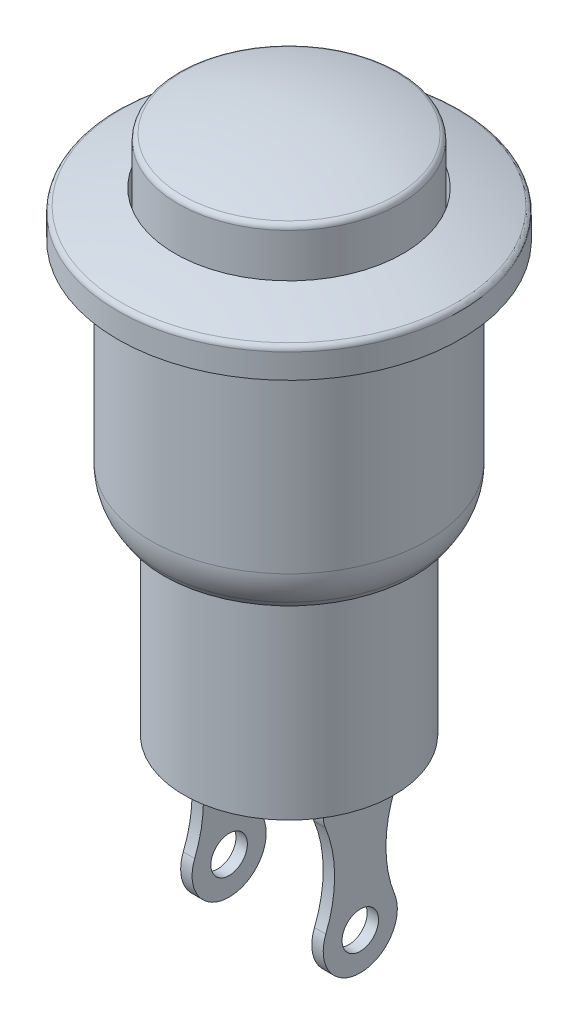
ISO-10303-21;
HEADER;
FILE_DESCRIPTION(('STEP AP214'),'2;1');
FILE_NAME('part.step','',(''),(''),'','','');
FILE_SCHEMA(('AUTOMOTIVE_DESIGN { 1 0 10303 214 1 1 1 1 }'));
ENDSEC;
DATA;
#1=APPLICATION_CONTEXT('core data for automotive mechanical design processes');
#2=APPLICATION_PROTOCOL_DEFINITION('international standard','automotive_design',2000,#1);
#3=PRODUCT_CONTEXT('',#1,'mechanical');
#4=PRODUCT('Part','Part','',(#3));
#5=PRODUCT_RELATED_PRODUCT_CATEGORY('part','',(#4));
#6=PRODUCT_DEFINITION_FORMATION('','',#4);
#7=PRODUCT_DEFINITION_CONTEXT('part definition',#1,'design');
#8=PRODUCT_DEFINITION('design','',#6,#7);
#9=PRODUCT_DEFINITION_SHAPE('','',#8);
#10=(LENGTH_UNIT() NAMED_UNIT(*) SI_UNIT(.MILLI.,.METRE.));
#11=(NAMED_UNIT(*) PLANE_ANGLE_UNIT() SI_UNIT($,.RADIAN.));
#12=(NAMED_UNIT(*) SI_UNIT($,.STERADIAN.) SOLID_ANGLE_UNIT());
#13=UNCERTAINTY_MEASURE_WITH_UNIT(LENGTH_MEASURE(1.E-05),#10,'distance_accuracy_value','');
#14=(GEOMETRIC_REPRESENTATION_CONTEXT(3) GLOBAL_UNCERTAINTY_ASSIGNED_CONTEXT((#13)) GLOBAL_UNIT_ASSIGNED_CONTEXT((#10,
#11,#12)) REPRESENTATION_CONTEXT('',''));
#15=CARTESIAN_POINT('',(0.,0.,0.));
#16=DIRECTION('',(0.,0.,1.));
#17=DIRECTION('',(1.,0.,0.));
#18=AXIS2_PLACEMENT_3D('',#15,#16,#17);
#19=CARTESIAN_POINT('',(-4.53278424106254,-11.3275862665259,23.5));
#20=DIRECTION('',(0.,0.,1.));
#21=DIRECTION('',(1.,0.,0.));
#22=AXIS2_PLACEMENT_3D('',#19,#20,#21);
#23=PLANE('',#22);
#24=DIRECTION('',(0.,1.,0.));
#25=VECTOR('',#24,1.);
#26=CARTESIAN_POINT('',(-4.13278424106254,-11.3275862665259,23.5));
#27=LINE('',#26,#25);
#28=CARTESIAN_POINT('',(-4.13278424106254,-5.91933866888955,23.5));
#29=VERTEX_POINT('',#28);
#30=CARTESIAN_POINT('',(-4.13278424106254,-5.32758626652589,23.5));
#31=VERTEX_POINT('',#30);
#32=EDGE_CURVE('E219',#29,#31,#27,.T.);
#33=ORIENTED_EDGE('',*,*,#32,.F.);
#34=DIRECTION('',(-1.,0.,0.));
#35=VECTOR('',#34,1.);
#36=CARTESIAN_POINT('',(-4.53278424106254,-5.91933866888955,23.5));
#37=LINE('',#36,#35);
#38=CARTESIAN_POINT('',(-4.53278424106254,-5.91933866888955,23.5));
#39=VERTEX_POINT('',#38);
#40=EDGE_CURVE('E24',#29,#39,#37,.T.);
#41=ORIENTED_EDGE('',*,*,#40,.T.);
#42=DIRECTION('',(0.,1.,0.));
#43=VECTOR('',#42,1.);
#44=CARTESIAN_POINT('',(-4.53278424106254,-11.3275862665259,23.5));
#45=LINE('',#44,#43);
#46=CARTESIAN_POINT('',(-4.53278424106254,-5.32758626652589,23.5));
#47=VERTEX_POINT('',#46);
#48=EDGE_CURVE('E221',#39,#47,#45,.T.);
#49=ORIENTED_EDGE('',*,*,#48,.T.);
#50=DIRECTION('',(1.,0.,0.));
#51=VECTOR('',#50,1.);
#52=CARTESIAN_POINT('',(-4.53278424106254,-5.32758626652589,23.5));
#53=LINE('',#52,#51);
#54=EDGE_CURVE('E206',#47,#31,#53,.T.);
#55=ORIENTED_EDGE('',*,*,#54,.T.);
#56=EDGE_LOOP('',(#33,#41,#49,#55));
#57=FACE_BOUND('',#56,.T.);
#58=ADVANCED_FACE('F16',(#57),#23,.F.);
#59=CARTESIAN_POINT('',(0.467215758937459,-11.3275862665259,23.5));
#60=DIRECTION('',(0.,0.,1.));
#61=DIRECTION('',(1.,0.,0.));
#62=AXIS2_PLACEMENT_3D('',#59,#60,#61);
#63=PLANE('',#62);
#64=DIRECTION('',(0.,1.,0.));
#65=VECTOR('',#64,1.);
#66=CARTESIAN_POINT('',(0.467215758937459,-11.3275862665259,23.5));
#67=LINE('',#66,#65);
#68=CARTESIAN_POINT('',(0.467215758937459,-5.91933866888955,23.5));
#69=VERTEX_POINT('',#68);
#70=CARTESIAN_POINT('',(0.467215758937459,-5.32758626652589,23.5));
#71=VERTEX_POINT('',#70);
#72=EDGE_CURVE('E197',#69,#71,#67,.T.);
#73=ORIENTED_EDGE('',*,*,#72,.F.);
#74=DIRECTION('',(-1.,0.,0.));
#75=VECTOR('',#74,1.);
#76=CARTESIAN_POINT('',(0.467215758937459,-5.91933866888955,23.5));
#77=LINE('',#76,#75);
#78=CARTESIAN_POINT('',(0.0672157589374587,-5.91933866888955,23.5));
#79=VERTEX_POINT('',#78);
#80=EDGE_CURVE('E295',#69,#79,#77,.T.);
#81=ORIENTED_EDGE('',*,*,#80,.T.);
#82=DIRECTION('',(0.,1.,0.));
#83=VECTOR('',#82,1.);
#84=CARTESIAN_POINT('',(0.0672157589374587,-11.3275862665259,23.5));
#85=LINE('',#84,#83);
#86=CARTESIAN_POINT('',(0.0672157589374587,-5.32758626652589,23.5));
#87=VERTEX_POINT('',#86);
#88=EDGE_CURVE('E199',#79,#87,#85,.T.);
#89=ORIENTED_EDGE('',*,*,#88,.T.);
#90=DIRECTION('',(1.,0.,0.));
#91=VECTOR('',#90,1.);
#92=CARTESIAN_POINT('',(0.467215758937459,-5.32758626652589,23.5));
#93=LINE('',#92,#91);
#94=EDGE_CURVE('E189',#87,#71,#93,.T.);
#95=ORIENTED_EDGE('',*,*,#94,.T.);
#96=EDGE_LOOP('',(#73,#81,#89,#95));
#97=FACE_BOUND('',#96,.T.);
#98=ADVANCED_FACE('F334',(#97),#63,.F.);
#99=CARTESIAN_POINT('',(-2.03278424106254,-5.32758626652589,24.8));
#100=DIRECTION('',(0.,-1.,0.));
#101=DIRECTION('',(0.,0.,-1.));
#102=AXIS2_PLACEMENT_3D('',#99,#100,#101);
#103=PLANE('',#102);
#104=ORIENTED_EDGE('',*,*,#54,.F.);
#105=DIRECTION('',(0.,0.,-1.));
#106=VECTOR('',#105,1.);
#107=CARTESIAN_POINT('',(-4.53278424106254,-5.32758626652589,26.1));
#108=LINE('',#107,#106);
#109=CARTESIAN_POINT('',(-4.53278424106254,-5.32758626652589,26.1));
#110=VERTEX_POINT('',#109);
#111=EDGE_CURVE('E203',#110,#47,#108,.T.);
#112=ORIENTED_EDGE('',*,*,#111,.F.);
#113=DIRECTION('',(-1.,0.,0.));
#114=VECTOR('',#113,1.);
#115=CARTESIAN_POINT('',(-4.53278424106254,-5.32758626652589,26.1));
#116=LINE('',#115,#114);
#117=CARTESIAN_POINT('',(-4.13278424106254,-5.32758626652589,26.1));
#118=VERTEX_POINT('',#117);
#119=EDGE_CURVE('E212',#118,#110,#116,.T.);
#120=ORIENTED_EDGE('',*,*,#119,.F.);
#121=DIRECTION('',(0.,0.,1.));
#122=VECTOR('',#121,1.);
#123=CARTESIAN_POINT('',(-4.13278424106254,-5.32758626652589,26.1));
#124=LINE('',#123,#122);
#125=EDGE_CURVE('E209',#31,#118,#124,.T.);
#126=ORIENTED_EDGE('',*,*,#125,.F.);
#127=EDGE_LOOP('',(#104,#112,#120,#126));
#128=FACE_BOUND('',#127,.T.);
#129=CARTESIAN_POINT('',(-2.03278424106254,-5.32758626652589,24.8));
#130=DIRECTION('',(0.,-1.,0.));
#131=DIRECTION('',(0.,0.,-1.));
#132=AXIS2_PLACEMENT_3D('',#129,#130,#131);
#133=CIRCLE('',#132,3.69);
#134=CARTESIAN_POINT('',(-2.03278424106254,-5.32758626652589,21.11));
#135=VERTEX_POINT('',#134);
#136=EDGE_CURVE('E232',#135,#135,#133,.T.);
#137=ORIENTED_EDGE('',*,*,#136,.T.);
#138=EDGE_LOOP('',(#137));
#139=FACE_BOUND('',#138,.T.);
#140=DIRECTION('',(0.,0.,-1.));
#141=VECTOR('',#140,1.);
#142=CARTESIAN_POINT('',(0.0672157589374591,-5.32758626652589,26.1));
#143=LINE('',#142,#141);
#144=CARTESIAN_POINT('',(0.0672157589374591,-5.32758626652589,26.1));
#145=VERTEX_POINT('',#144);
#146=EDGE_CURVE('E186',#145,#87,#143,.T.);
#147=ORIENTED_EDGE('',*,*,#146,.F.);
#148=DIRECTION('',(-1.,0.,0.));
#149=VECTOR('',#148,1.);
#150=CARTESIAN_POINT('',(0.467215758937459,-5.32758626652589,26.1));
#151=LINE('',#150,#149);
#152=CARTESIAN_POINT('',(0.467215758937459,-5.32758626652589,26.1));
#153=VERTEX_POINT('',#152);
#154=EDGE_CURVE('E183',#153,#145,#151,.T.);
#155=ORIENTED_EDGE('',*,*,#154,.F.);
#156=DIRECTION('',(0.,0.,1.));
#157=VECTOR('',#156,1.);
#158=CARTESIAN_POINT('',(0.467215758937459,-5.32758626652589,26.1));
#159=LINE('',#158,#157);
#160=EDGE_CURVE('E192',#71,#153,#159,.T.);
#161=ORIENTED_EDGE('',*,*,#160,.F.);
#162=ORIENTED_EDGE('',*,*,#94,.F.);
#163=EDGE_LOOP('',(#147,#155,#161,#162));
#164=FACE_BOUND('',#163,.T.);
#165=ADVANCED_FACE('F310',(#128,#139,#164),#103,.T.);
#166=CARTESIAN_POINT('',(-2.03278424106254,-5.32758626652589,24.8));
#167=DIRECTION('',(0.,-1.,0.));
#168=DIRECTION('',(0.,0.,-1.));
#169=AXIS2_PLACEMENT_3D('',#166,#167,#168);
#170=CYLINDRICAL_SURFACE('',#169,6.01);
#171=CARTESIAN_POINT('',(-2.03278424106254,10.5319052782596,24.8));
#172=DIRECTION('',(0.,-1.,0.));
#173=DIRECTION('',(0.,0.,-1.));
#174=AXIS2_PLACEMENT_3D('',#171,#172,#173);
#175=CIRCLE('',#174,6.01);
#176=CARTESIAN_POINT('',(-2.03278424106254,10.5319052782596,18.79));
#177=VERTEX_POINT('',#176);
#178=EDGE_CURVE('E250',#177,#177,#175,.T.);
#179=ORIENTED_EDGE('',*,*,#178,.T.);
#180=EDGE_LOOP('',(#179));
#181=FACE_BOUND('',#180,.T.);
#182=CARTESIAN_POINT('',(-2.03278424106254,9.67241373347411,24.8));
#183=DIRECTION('',(0.,-1.,0.));
#184=DIRECTION('',(0.,0.,-1.));
#185=AXIS2_PLACEMENT_3D('',#182,#183,#184);
#186=CIRCLE('',#185,6.01);
#187=CARTESIAN_POINT('',(-2.03278424106254,9.67241373347411,18.79));
#188=VERTEX_POINT('',#187);
#189=EDGE_CURVE('E223',#188,#188,#186,.T.);
#190=ORIENTED_EDGE('',*,*,#189,.F.);
#191=EDGE_LOOP('',(#190));
#192=FACE_BOUND('',#191,.T.);
#193=ADVANCED_FACE('F366',(#181,#192),#170,.T.);
#194=CARTESIAN_POINT('',(-2.03278424106254,-5.79433626652587,24.8));
#195=DIRECTION('',(0.,-1.,0.));
#196=DIRECTION('',(1.,0.,0.));
#197=AXIS2_PLACEMENT_3D('',#194,#195,#196);
#198=SPHERICAL_SURFACE('',#197,17.5292314595506);
#199=CARTESIAN_POINT('',(-2.03278424106254,10.720329578355,24.8));
#200=DIRECTION('',(0.,-1.,0.));
#201=DIRECTION('',(0.,0.,-1.));
#202=AXIS2_PLACEMENT_3D('',#199,#200,#201);
#203=CIRCLE('',#202,5.87705432971521);
#204=CARTESIAN_POINT('',(-2.03278424106254,10.720329578355,18.9229456702848));
#205=VERTEX_POINT('',#204);
#206=EDGE_CURVE('E253',#205,#205,#203,.F.);
#207=ORIENTED_EDGE('',*,*,#206,.T.);
#208=EDGE_LOOP('',(#207));
#209=FACE_BOUND('',#208,.T.);
#210=CARTESIAN_POINT('',(-2.03278424106254,11.2724137334741,24.8));
#211=DIRECTION('',(0.,-1.,0.));
#212=DIRECTION('',(0.,0.,-1.));
#213=AXIS2_PLACEMENT_3D('',#210,#211,#212);
#214=CIRCLE('',#213,4.);
#215=CARTESIAN_POINT('',(-2.03278424106254,11.2724137334741,20.8));
#216=VERTEX_POINT('',#215);
#217=EDGE_CURVE('E241',#216,#216,#214,.T.);
#218=ORIENTED_EDGE('',*,*,#217,.T.);
#219=EDGE_LOOP('',(#218));
#220=FACE_BOUND('',#219,.T.);
#221=ADVANCED_FACE('F381',(#209,#220),#198,.T.);
#222=CARTESIAN_POINT('',(-2.03278424106254,-5.32758626652589,24.8));
#223=DIRECTION('',(0.,-1.,0.));
#224=DIRECTION('',(0.,0.,-1.));
#225=AXIS2_PLACEMENT_3D('',#222,#223,#224);
#226=CYLINDRICAL_SURFACE('',#225,4.);
#227=CARTESIAN_POINT('',(-2.03278424106254,9.68560437141453,24.8));
#228=DIRECTION('',(0.,-1.,0.));
#229=DIRECTION('',(0.,0.,-1.));
#230=AXIS2_PLACEMENT_3D('',#227,#228,#229);
#231=CIRCLE('',#230,4.);
#232=CARTESIAN_POINT('',(-2.03278424106254,9.68560437141453,20.8));
#233=VERTEX_POINT('',#232);
#234=EDGE_CURVE('E238',#233,#233,#231,.T.);
#235=ORIENTED_EDGE('',*,*,#234,.T.);
#236=EDGE_LOOP('',(#235));
#237=FACE_BOUND('',#236,.T.);
#238=ORIENTED_EDGE('',*,*,#217,.F.);
#239=EDGE_LOOP('',(#238));
#240=FACE_BOUND('',#239,.T.);
#241=ADVANCED_FACE('F377',(#237,#240),#226,.F.);
#242=CARTESIAN_POINT('',(-2.03278424106254,9.68560437141453,24.8));
#243=DIRECTION('',(0.,1.,0.));
#244=DIRECTION('',(0.,0.,1.));
#245=AXIS2_PLACEMENT_3D('',#242,#243,#244);
#246=PLANE('',#245);
#247=CARTESIAN_POINT('',(-2.03278424106254,9.68560437141453,24.8));
#248=DIRECTION('',(0.,-1.,0.));
#249=DIRECTION('',(0.,0.,-1.));
#250=AXIS2_PLACEMENT_3D('',#247,#248,#249);
#251=CIRCLE('',#250,3.89);
#252=CARTESIAN_POINT('',(-2.03278424106254,9.68560437141453,20.91));
#253=VERTEX_POINT('',#252);
#254=EDGE_CURVE('E235',#253,#253,#251,.T.);
#255=ORIENTED_EDGE('',*,*,#254,.T.);
#256=EDGE_LOOP('',(#255));
#257=FACE_BOUND('',#256,.T.);
#258=ORIENTED_EDGE('',*,*,#234,.F.);
#259=EDGE_LOOP('',(#258));
#260=FACE_BOUND('',#259,.T.);
#261=ADVANCED_FACE('F373',(#257,#260),#246,.T.);
#262=CARTESIAN_POINT('',(-2.03278424106254,-5.32758626652589,24.8));
#263=DIRECTION('',(0.,-1.,0.));
#264=DIRECTION('',(0.,0.,-1.));
#265=AXIS2_PLACEMENT_3D('',#262,#263,#264);
#266=CYLINDRICAL_SURFACE('',#265,3.89);
#267=CARTESIAN_POINT('',(-2.03278424106254,12.7249830031003,24.8));
#268=DIRECTION('',(0.,-1.,0.));
#269=DIRECTION('',(0.,0.,-1.));
#270=AXIS2_PLACEMENT_3D('',#267,#268,#269);
#271=CIRCLE('',#270,3.89);
#272=CARTESIAN_POINT('',(-2.03278424106254,12.7249830031003,20.91));
#273=VERTEX_POINT('',#272);
#274=EDGE_CURVE('E244',#273,#273,#271,.T.);
#275=ORIENTED_EDGE('',*,*,#274,.T.);
#276=EDGE_LOOP('',(#275));
#277=FACE_BOUND('',#276,.T.);
#278=ORIENTED_EDGE('',*,*,#254,.F.);
#279=EDGE_LOOP('',(#278));
#280=FACE_BOUND('',#279,.T.);
#281=ADVANCED_FACE('F369',(#277,#280),#266,.T.);
#282=CARTESIAN_POINT('',(-2.03278424106254,0.562330400140781,24.8));
#283=DIRECTION('',(0.,-1.,0.));
#284=DIRECTION('',(1.,0.,0.));
#285=AXIS2_PLACEMENT_3D('',#282,#283,#284);
#286=SPHERICAL_SURFACE('',#285,12.9100833333333);
#287=CARTESIAN_POINT('',(-2.03278424106254,12.9163688860089,24.8));
#288=DIRECTION('',(0.,-1.,0.));
#289=DIRECTION('',(0.,0.,-1.));
#290=AXIS2_PLACEMENT_3D('',#287,#288,#289);
#291=CIRCLE('',#290,3.74806413543053);
#292=CARTESIAN_POINT('',(-2.03278424106254,12.9163688860089,21.0519358645695));
#293=VERTEX_POINT('',#292);
#294=EDGE_CURVE('E247',#293,#293,#291,.F.);
#295=ORIENTED_EDGE('',*,*,#294,.T.);
#296=EDGE_LOOP('',(#295));
#297=FACE_BOUND('',#296,.T.);
#298=ADVANCED_FACE('F362',(#297),#286,.T.);
#299=CARTESIAN_POINT('',(-2.03278424106254,-5.32758626652589,24.8));
#300=DIRECTION('',(0.,-1.,0.));
#301=DIRECTION('',(0.,0.,-1.));
#302=AXIS2_PLACEMENT_3D('',#299,#300,#301);
#303=CYLINDRICAL_SURFACE('',#302,3.69);
#304=CARTESIAN_POINT('',(-2.03278424106254,1.67241373347411,24.8));
#305=DIRECTION('',(0.,-1.,0.));
#306=DIRECTION('',(0.,0.,-1.));
#307=AXIS2_PLACEMENT_3D('',#304,#305,#306);
#308=CIRCLE('',#307,3.69);
#309=CARTESIAN_POINT('',(-2.03278424106254,1.67241373347411,21.11));
#310=VERTEX_POINT('',#309);
#311=EDGE_CURVE('E229',#310,#310,#308,.T.);
#312=ORIENTED_EDGE('',*,*,#311,.T.);
#313=EDGE_LOOP('',(#312));
#314=FACE_BOUND('',#313,.T.);
#315=ORIENTED_EDGE('',*,*,#136,.F.);
#316=EDGE_LOOP('',(#315));
#317=FACE_BOUND('',#316,.T.);
#318=ADVANCED_FACE('F358',(#314,#317),#303,.T.);
#319=CARTESIAN_POINT('',(-2.03278424106254,1.67241373347411,24.8));
#320=DIRECTION('',(0.,-1.,0.));
#321=DIRECTION('',(0.,0.,-1.));
#322=AXIS2_PLACEMENT_3D('',#319,#320,#321);
#323=PLANE('',#322);
#324=CARTESIAN_POINT('',(-2.03278424106254,1.67241373347411,24.8));
#325=DIRECTION('',(0.,-1.,0.));
#326=DIRECTION('',(0.,0.,-1.));
#327=AXIS2_PLACEMENT_3D('',#324,#325,#326);
#328=CIRCLE('',#327,4.38541468476175);
#329=CARTESIAN_POINT('',(-2.03278424106254,1.67241373347411,20.4145853152383));
#330=VERTEX_POINT('',#329);
#331=EDGE_CURVE('E256',#330,#330,#328,.T.);
#332=ORIENTED_EDGE('',*,*,#331,.T.);
#333=EDGE_LOOP('',(#332));
#334=FACE_BOUND('',#333,.T.);
#335=ORIENTED_EDGE('',*,*,#311,.F.);
#336=EDGE_LOOP('',(#335));
#337=FACE_BOUND('',#336,.T.);
#338=ADVANCED_FACE('F354',(#334,#337),#323,.T.);
#339=CARTESIAN_POINT('',(-2.03278424106254,-5.32758626652589,24.8));
#340=DIRECTION('',(0.,-1.,0.));
#341=DIRECTION('',(0.,0.,-1.));
#342=AXIS2_PLACEMENT_3D('',#339,#340,#341);
#343=CYLINDRICAL_SURFACE('',#342,4.84);
#344=CARTESIAN_POINT('',(-2.03278424106254,2.96484072339826,24.8));
#345=DIRECTION('',(0.,-1.,0.));
#346=DIRECTION('',(0.,0.,-1.));
#347=AXIS2_PLACEMENT_3D('',#344,#345,#346);
#348=CIRCLE('',#347,4.84);
#349=CARTESIAN_POINT('',(-2.03278424106254,2.96484072339826,19.96));
#350=VERTEX_POINT('',#349);
#351=EDGE_CURVE('E259',#350,#350,#348,.F.);
#352=ORIENTED_EDGE('',*,*,#351,.T.);
#353=EDGE_LOOP('',(#352));
#354=FACE_BOUND('',#353,.T.);
#355=CARTESIAN_POINT('',(-2.03278424106254,9.67241373347411,24.8));
#356=DIRECTION('',(0.,-1.,0.));
#357=DIRECTION('',(0.,0.,-1.));
#358=AXIS2_PLACEMENT_3D('',#355,#356,#357);
#359=CIRCLE('',#358,4.84);
#360=CARTESIAN_POINT('',(-2.03278424106254,9.67241373347411,19.96));
#361=VERTEX_POINT('',#360);
#362=EDGE_CURVE('E226',#361,#361,#359,.T.);
#363=ORIENTED_EDGE('',*,*,#362,.T.);
#364=EDGE_LOOP('',(#363));
#365=FACE_BOUND('',#364,.T.);
#366=ADVANCED_FACE('F350',(#354,#365),#343,.T.);
#367=CARTESIAN_POINT('',(-2.03278424106254,9.67241373347411,24.8));
#368=DIRECTION('',(0.,-1.,0.));
#369=DIRECTION('',(0.,0.,-1.));
#370=AXIS2_PLACEMENT_3D('',#367,#368,#369);
#371=PLANE('',#370);
#372=ORIENTED_EDGE('',*,*,#189,.T.);
#373=EDGE_LOOP('',(#372));
#374=FACE_BOUND('',#373,.T.);
#375=ORIENTED_EDGE('',*,*,#362,.F.);
#376=EDGE_LOOP('',(#375));
#377=FACE_BOUND('',#376,.T.);
#378=ADVANCED_FACE('F346',(#374,#377),#371,.T.);
#379=CARTESIAN_POINT('',(-2.03278424106254,12.7249830031003,24.8));
#380=DIRECTION('',(0.,-1.,0.));
#381=DIRECTION('',(0.,0.,-1.));
#382=AXIS2_PLACEMENT_3D('',#379,#380,#381);
#383=TOROIDAL_SURFACE('',#382,3.69,0.2);
#384=ORIENTED_EDGE('',*,*,#294,.F.);
#385=EDGE_LOOP('',(#384));
#386=FACE_BOUND('',#385,.T.);
#387=ORIENTED_EDGE('',*,*,#274,.F.);
#388=EDGE_LOOP('',(#387));
#389=FACE_BOUND('',#388,.T.);
#390=ADVANCED_FACE('F349',(#386,#389),#383,.T.);
#391=CARTESIAN_POINT('',(-2.03278424106254,10.5319052782596,24.8));
#392=DIRECTION('',(0.,-1.,0.));
#393=DIRECTION('',(0.,0.,-1.));
#394=AXIS2_PLACEMENT_3D('',#391,#392,#393);
#395=TOROIDAL_SURFACE('',#394,5.81,0.2);
#396=ORIENTED_EDGE('',*,*,#206,.F.);
#397=EDGE_LOOP('',(#396));
#398=FACE_BOUND('',#397,.T.);
#399=ORIENTED_EDGE('',*,*,#178,.F.);
#400=EDGE_LOOP('',(#399));
#401=FACE_BOUND('',#400,.T.);
#402=ADVANCED_FACE('F391',(#398,#401),#395,.T.);
#403=CARTESIAN_POINT('',(-2.03278424106254,1.67241373347411,24.8));
#404=DIRECTION('',(0.,1.,0.));
#405=DIRECTION('',(0.,0.,1.));
#406=AXIS2_PLACEMENT_3D('',#403,#404,#405);
#407=CONICAL_SURFACE('',#406,4.38541468476175,0.575958653158124);
#408=CARTESIAN_POINT('',(-2.03278424106254,1.87556265336822,24.8));
#409=DIRECTION('',(0.,-1.,0.));
#410=DIRECTION('',(0.,0.,-1.));
#411=AXIS2_PLACEMENT_3D('',#408,#409,#410);
#412=CIRCLE('',#411,4.51734113589085);
#413=CARTESIAN_POINT('',(-2.03278424106254,1.87556265336822,20.2826588641092));
#414=VERTEX_POINT('',#413);
#415=EDGE_CURVE('E262',#414,#414,#412,.T.);
#416=ORIENTED_EDGE('',*,*,#415,.T.);
#417=EDGE_LOOP('',(#416));
#418=FACE_BOUND('',#417,.T.);
#419=ORIENTED_EDGE('',*,*,#331,.F.);
#420=EDGE_LOOP('',(#419));
#421=FACE_BOUND('',#420,.T.);
#422=ADVANCED_FACE('F395',(#418,#421),#407,.T.);
#423=CARTESIAN_POINT('',(-2.03278424106254,2.96484072339826,24.8));
#424=DIRECTION('',(0.,-1.,0.));
#425=DIRECTION('',(0.,0.,-1.));
#426=AXIS2_PLACEMENT_3D('',#423,#424,#425);
#427=TOROIDAL_SURFACE('',#426,2.84,2.);
#428=ORIENTED_EDGE('',*,*,#415,.F.);
#429=EDGE_LOOP('',(#428));
#430=FACE_BOUND('',#429,.T.);
#431=ORIENTED_EDGE('',*,*,#351,.F.);
#432=EDGE_LOOP('',(#431));
#433=FACE_BOUND('',#432,.T.);
#434=ADVANCED_FACE('F344',(#430,#433),#427,.T.);
#435=CARTESIAN_POINT('',(-4.53278424106254,-11.3275862665259,26.1));
#436=DIRECTION('',(1.,0.,0.));
#437=DIRECTION('',(0.,0.,-1.));
#438=AXIS2_PLACEMENT_3D('',#435,#436,#437);
#439=PLANE('',#438);
#440=CARTESIAN_POINT('',(-4.53278424106254,-10.0275862665259,24.8));
#441=DIRECTION('',(-1.,0.,0.));
#442=DIRECTION('',(0.,0.,1.));
#443=AXIS2_PLACEMENT_3D('',#440,#441,#442);
#444=CIRCLE('',#443,0.64);
#445=CARTESIAN_POINT('',(-4.53278424106254,-10.0275862665259,25.44));
#446=VERTEX_POINT('',#445);
#447=EDGE_CURVE('E173',#446,#446,#444,.T.);
#448=ORIENTED_EDGE('',*,*,#447,.F.);
#449=EDGE_LOOP('',(#448));
#450=FACE_BOUND('',#449,.T.);
#451=CARTESIAN_POINT('',(-4.53278424106254,-7.94425293319255,30.0253472222222));
#452=DIRECTION('',(-1.,0.,0.));
#453=DIRECTION('',(0.,0.,-1.));
#454=AXIS2_PLACEMENT_3D('',#451,#452,#453);
#455=CIRCLE('',#454,4.32534722222222);
#456=CARTESIAN_POINT('',(-4.53278424106254,-6.29957946442927,26.0248875268957));
#457=VERTEX_POINT('',#456);
#458=CARTESIAN_POINT('',(-4.53278424106254,-9.54613450428899,26.0075612616505));
#459=VERTEX_POINT('',#458);
#460=EDGE_CURVE('E130',#457,#459,#455,.T.);
#461=ORIENTED_EDGE('',*,*,#460,.F.);
#462=CARTESIAN_POINT('',(-4.53278424106254,-5.91933866888955,25.1));
#463=DIRECTION('',(1.,0.,0.));
#464=DIRECTION('',(0.,0.,-1.));
#465=AXIS2_PLACEMENT_3D('',#462,#463,#464);
#466=CIRCLE('',#465,1.);
#467=CARTESIAN_POINT('',(-4.53278424106254,-5.91933866888955,26.1));
#468=VERTEX_POINT('',#467);
#469=EDGE_CURVE('E288',#457,#468,#466,.F.);
#470=ORIENTED_EDGE('',*,*,#469,.T.);
#471=DIRECTION('',(0.,1.,0.));
#472=VECTOR('',#471,1.);
#473=CARTESIAN_POINT('',(-4.53278424106254,-11.3275862665259,26.1));
#474=LINE('',#473,#472);
#475=EDGE_CURVE('E215',#468,#110,#474,.T.);
#476=ORIENTED_EDGE('',*,*,#475,.T.);
#477=ORIENTED_EDGE('',*,*,#111,.T.);
#478=ORIENTED_EDGE('',*,*,#48,.F.);
#479=CARTESIAN_POINT('',(-4.53278424106254,-5.91933866888955,24.5));
#480=DIRECTION('',(1.,0.,0.));
#481=DIRECTION('',(0.,0.,-1.));
#482=AXIS2_PLACEMENT_3D('',#479,#480,#481);
#483=CIRCLE('',#482,1.);
#484=CARTESIAN_POINT('',(-4.53278424106254,-6.29957946442926,23.5751124731043));
#485=VERTEX_POINT('',#484);
#486=EDGE_CURVE('E286',#39,#485,#483,.F.);
#487=ORIENTED_EDGE('',*,*,#486,.T.);
#488=CARTESIAN_POINT('',(-4.53278424106254,-7.94425293319255,19.5746527777778));
#489=DIRECTION('',(-1.,0.,0.));
#490=DIRECTION('',(0.,0.,1.));
#491=AXIS2_PLACEMENT_3D('',#488,#489,#490);
#492=CIRCLE('',#491,4.32534722222222);
#493=CARTESIAN_POINT('',(-4.53278424106254,-9.54613450428899,23.5924387383495));
#494=VERTEX_POINT('',#493);
#495=EDGE_CURVE('E144',#494,#485,#492,.T.);
#496=ORIENTED_EDGE('',*,*,#495,.F.);
#497=CARTESIAN_POINT('',(-4.53278424106254,-10.0275862665259,24.8));
#498=DIRECTION('',(1.,0.,0.));
#499=DIRECTION('',(0.,0.,1.));
#500=AXIS2_PLACEMENT_3D('',#497,#498,#499);
#501=CIRCLE('',#500,1.3);
#502=EDGE_CURVE('E139',#459,#494,#501,.T.);
#503=ORIENTED_EDGE('',*,*,#502,.F.);
#504=EDGE_LOOP('',(#461,#470,#476,#477,#478,#487,#496,#503));
#505=FACE_BOUND('',#504,.T.);
#506=ADVANCED_FACE('F143',(#450,#505),#439,.F.);
#507=CARTESIAN_POINT('',(-4.13278424106254,-11.3275862665259,26.1));
#508=DIRECTION('',(-1.,0.,0.));
#509=DIRECTION('',(0.,0.,1.));
#510=AXIS2_PLACEMENT_3D('',#507,#508,#509);
#511=PLANE('',#510);
#512=CARTESIAN_POINT('',(-4.13278424106254,-10.0275862665259,24.8));
#513=DIRECTION('',(-1.,0.,0.));
#514=DIRECTION('',(0.,0.,1.));
#515=AXIS2_PLACEMENT_3D('',#512,#513,#514);
#516=CIRCLE('',#515,0.64);
#517=CARTESIAN_POINT('',(-4.13278424106254,-10.0275862665259,25.44));
#518=VERTEX_POINT('',#517);
#519=EDGE_CURVE('E180',#518,#518,#516,.T.);
#520=ORIENTED_EDGE('',*,*,#519,.T.);
#521=EDGE_LOOP('',(#520));
#522=FACE_BOUND('',#521,.T.);
#523=DIRECTION('',(0.,1.,0.));
#524=VECTOR('',#523,1.);
#525=CARTESIAN_POINT('',(-4.13278424106254,-11.3275862665259,26.1));
#526=LINE('',#525,#524);
#527=CARTESIAN_POINT('',(-4.13278424106254,-5.91933866888955,26.1));
#528=VERTEX_POINT('',#527);
#529=EDGE_CURVE('E217',#528,#118,#526,.T.);
#530=ORIENTED_EDGE('',*,*,#529,.F.);
#531=CARTESIAN_POINT('',(-4.13278424106254,-5.91933866888955,25.1));
#532=DIRECTION('',(-1.,0.,0.));
#533=DIRECTION('',(0.,0.,1.));
#534=AXIS2_PLACEMENT_3D('',#531,#532,#533);
#535=CIRCLE('',#534,1.);
#536=CARTESIAN_POINT('',(-4.13278424106254,-6.29957946442927,26.0248875268957));
#537=VERTEX_POINT('',#536);
#538=EDGE_CURVE('E293',#528,#537,#535,.F.);
#539=ORIENTED_EDGE('',*,*,#538,.T.);
#540=CARTESIAN_POINT('',(-4.13278424106254,-7.94425293319255,30.0253472222222));
#541=DIRECTION('',(-1.,0.,0.));
#542=DIRECTION('',(0.,0.,1.));
#543=AXIS2_PLACEMENT_3D('',#540,#541,#542);
#544=CIRCLE('',#543,4.32534722222222);
#545=CARTESIAN_POINT('',(-4.13278424106254,-9.54613450428899,26.0075612616505));
#546=VERTEX_POINT('',#545);
#547=EDGE_CURVE('E171',#537,#546,#544,.T.);
#548=ORIENTED_EDGE('',*,*,#547,.T.);
#549=CARTESIAN_POINT('',(-4.13278424106254,-10.0275862665259,24.8));
#550=DIRECTION('',(-1.,0.,0.));
#551=DIRECTION('',(0.,0.,1.));
#552=AXIS2_PLACEMENT_3D('',#549,#550,#551);
#553=CIRCLE('',#552,1.3);
#554=CARTESIAN_POINT('',(-4.13278424106254,-9.54613450428899,23.5924387383495));
#555=VERTEX_POINT('',#554);
#556=EDGE_CURVE('E150',#546,#555,#553,.F.);
#557=ORIENTED_EDGE('',*,*,#556,.T.);
#558=CARTESIAN_POINT('',(-4.13278424106254,-7.94425293319255,19.5746527777778));
#559=DIRECTION('',(-1.,0.,0.));
#560=DIRECTION('',(0.,0.,1.));
#561=AXIS2_PLACEMENT_3D('',#558,#559,#560);
#562=CIRCLE('',#561,4.32534722222222);
#563=CARTESIAN_POINT('',(-4.13278424106254,-6.29957946442926,23.5751124731043));
#564=VERTEX_POINT('',#563);
#565=EDGE_CURVE('E166',#555,#564,#562,.T.);
#566=ORIENTED_EDGE('',*,*,#565,.T.);
#567=CARTESIAN_POINT('',(-4.13278424106254,-5.91933866888955,24.5));
#568=DIRECTION('',(-1.,0.,0.));
#569=DIRECTION('',(0.,0.,1.));
#570=AXIS2_PLACEMENT_3D('',#567,#568,#569);
#571=CIRCLE('',#570,1.);
#572=EDGE_CURVE('E31',#564,#29,#571,.F.);
#573=ORIENTED_EDGE('',*,*,#572,.T.);
#574=ORIENTED_EDGE('',*,*,#32,.T.);
#575=ORIENTED_EDGE('',*,*,#125,.T.);
#576=EDGE_LOOP('',(#530,#539,#548,#557,#566,#573,#574,#575));
#577=FACE_BOUND('',#576,.T.);
#578=ADVANCED_FACE('F313',(#522,#577),#511,.F.);
#579=CARTESIAN_POINT('',(-4.53278424106254,-11.3275862665259,26.1));
#580=DIRECTION('',(0.,0.,-1.));
#581=DIRECTION('',(-1.,0.,0.));
#582=AXIS2_PLACEMENT_3D('',#579,#580,#581);
#583=PLANE('',#582);
#584=ORIENTED_EDGE('',*,*,#475,.F.);
#585=DIRECTION('',(-1.,0.,0.));
#586=VECTOR('',#585,1.);
#587=CARTESIAN_POINT('',(-4.53278424106254,-5.91933866888955,26.1));
#588=LINE('',#587,#586);
#589=EDGE_CURVE('E290',#468,#528,#588,.F.);
#590=ORIENTED_EDGE('',*,*,#589,.T.);
#591=ORIENTED_EDGE('',*,*,#529,.T.);
#592=ORIENTED_EDGE('',*,*,#119,.T.);
#593=EDGE_LOOP('',(#584,#590,#591,#592));
#594=FACE_BOUND('',#593,.T.);
#595=ADVANCED_FACE('F319',(#594),#583,.F.);
#596=CARTESIAN_POINT('',(0.467215758937459,-11.3275862665259,26.1));
#597=DIRECTION('',(0.,0.,-1.));
#598=DIRECTION('',(-1.,0.,0.));
#599=AXIS2_PLACEMENT_3D('',#596,#597,#598);
#600=PLANE('',#599);
#601=DIRECTION('',(0.,1.,0.));
#602=VECTOR('',#601,1.);
#603=CARTESIAN_POINT('',(0.0672157589374591,-11.3275862665259,26.1));
#604=LINE('',#603,#602);
#605=CARTESIAN_POINT('',(0.0672157589374591,-5.91933866888955,26.1));
#606=VERTEX_POINT('',#605);
#607=EDGE_CURVE('E201',#606,#145,#604,.T.);
#608=ORIENTED_EDGE('',*,*,#607,.F.);
#609=DIRECTION('',(-1.,0.,0.));
#610=VECTOR('',#609,1.);
#611=CARTESIAN_POINT('',(0.467215758937459,-5.91933866888955,26.1));
#612=LINE('',#611,#610);
#613=CARTESIAN_POINT('',(0.467215758937459,-5.91933866888955,26.1));
#614=VERTEX_POINT('',#613);
#615=EDGE_CURVE('E279',#606,#614,#612,.F.);
#616=ORIENTED_EDGE('',*,*,#615,.T.);
#617=DIRECTION('',(0.,1.,0.));
#618=VECTOR('',#617,1.);
#619=CARTESIAN_POINT('',(0.467215758937459,-11.3275862665259,26.1));
#620=LINE('',#619,#618);
#621=EDGE_CURVE('E195',#614,#153,#620,.T.);
#622=ORIENTED_EDGE('',*,*,#621,.T.);
#623=ORIENTED_EDGE('',*,*,#154,.T.);
#624=EDGE_LOOP('',(#608,#616,#622,#623));
#625=FACE_BOUND('',#624,.T.);
#626=ADVANCED_FACE('F321',(#625),#600,.F.);
#627=CARTESIAN_POINT('',(0.0672157589374591,-11.3275862665259,26.1));
#628=DIRECTION('',(1.,0.,0.));
#629=DIRECTION('',(0.,0.,-1.));
#630=AXIS2_PLACEMENT_3D('',#627,#628,#629);
#631=PLANE('',#630);
#632=CARTESIAN_POINT('',(0.0672157589374587,-10.0275862665259,24.8));
#633=DIRECTION('',(1.,0.,0.));
#634=DIRECTION('',(0.,0.,-1.));
#635=AXIS2_PLACEMENT_3D('',#632,#633,#634);
#636=CIRCLE('',#635,0.64);
#637=CARTESIAN_POINT('',(0.0672157589374586,-10.0275862665259,24.16));
#638=VERTEX_POINT('',#637);
#639=EDGE_CURVE('E177',#638,#638,#636,.T.);
#640=ORIENTED_EDGE('',*,*,#639,.T.);
#641=EDGE_LOOP('',(#640));
#642=FACE_BOUND('',#641,.T.);
#643=CARTESIAN_POINT('',(0.0672157589374596,-7.94425293319255,30.0253472222222));
#644=DIRECTION('',(1.,0.,0.));
#645=DIRECTION('',(0.,0.,-1.));
#646=AXIS2_PLACEMENT_3D('',#643,#644,#645);
#647=CIRCLE('',#646,4.32534722222222);
#648=CARTESIAN_POINT('',(0.0672157589374587,-9.54613450428899,26.0075612616505));
#649=VERTEX_POINT('',#648);
#650=CARTESIAN_POINT('',(0.0672157589374587,-6.29957946442927,26.0248875268957));
#651=VERTEX_POINT('',#650);
#652=EDGE_CURVE('E168',#649,#651,#647,.T.);
#653=ORIENTED_EDGE('',*,*,#652,.T.);
#654=CARTESIAN_POINT('',(0.0672157589374587,-5.91933866888955,25.1));
#655=DIRECTION('',(1.,0.,0.));
#656=DIRECTION('',(0.,0.,-1.));
#657=AXIS2_PLACEMENT_3D('',#654,#655,#656);
#658=CIRCLE('',#657,1.);
#659=EDGE_CURVE('E277',#651,#606,#658,.F.);
#660=ORIENTED_EDGE('',*,*,#659,.T.);
#661=ORIENTED_EDGE('',*,*,#607,.T.);
#662=ORIENTED_EDGE('',*,*,#146,.T.);
#663=ORIENTED_EDGE('',*,*,#88,.F.);
#664=CARTESIAN_POINT('',(0.0672157589374587,-5.91933866888955,24.5));
#665=DIRECTION('',(1.,0.,0.));
#666=DIRECTION('',(0.,0.,-1.));
#667=AXIS2_PLACEMENT_3D('',#664,#665,#666);
#668=CIRCLE('',#667,1.);
#669=CARTESIAN_POINT('',(0.0672157589374587,-6.29957946442926,23.5751124731043));
#670=VERTEX_POINT('',#669);
#671=EDGE_CURVE('E275',#79,#670,#668,.F.);
#672=ORIENTED_EDGE('',*,*,#671,.T.);
#673=CARTESIAN_POINT('',(0.0672157589374578,-7.94425293319255,19.5746527777778));
#674=DIRECTION('',(1.,0.,0.));
#675=DIRECTION('',(0.,0.,-1.));
#676=AXIS2_PLACEMENT_3D('',#673,#674,#675);
#677=CIRCLE('',#676,4.32534722222222);
#678=CARTESIAN_POINT('',(0.0672157589374587,-9.54613450428899,23.5924387383495));
#679=VERTEX_POINT('',#678);
#680=EDGE_CURVE('E164',#670,#679,#677,.T.);
#681=ORIENTED_EDGE('',*,*,#680,.T.);
#682=CARTESIAN_POINT('',(0.0672157589374587,-10.0275862665259,24.8));
#683=DIRECTION('',(1.,0.,0.));
#684=DIRECTION('',(0.,0.,-1.));
#685=AXIS2_PLACEMENT_3D('',#682,#683,#684);
#686=CIRCLE('',#685,1.3);
#687=EDGE_CURVE('E160',#679,#649,#686,.F.);
#688=ORIENTED_EDGE('',*,*,#687,.T.);
#689=EDGE_LOOP('',(#653,#660,#661,#662,#663,#672,#681,#688));
#690=FACE_BOUND('',#689,.T.);
#691=ADVANCED_FACE('F328',(#642,#690),#631,.F.);
#692=CARTESIAN_POINT('',(0.467215758937459,-11.3275862665259,26.1));
#693=DIRECTION('',(-1.,0.,0.));
#694=DIRECTION('',(0.,0.,1.));
#695=AXIS2_PLACEMENT_3D('',#692,#693,#694);
#696=PLANE('',#695);
#697=CARTESIAN_POINT('',(0.467215758937459,-10.0275862665259,24.8));
#698=DIRECTION('',(-1.,0.,0.));
#699=DIRECTION('',(0.,0.,1.));
#700=AXIS2_PLACEMENT_3D('',#697,#698,#699);
#701=CIRCLE('',#700,0.64);
#702=CARTESIAN_POINT('',(0.467215758937459,-10.0275862665259,25.44));
#703=VERTEX_POINT('',#702);
#704=EDGE_CURVE('E176',#703,#703,#701,.T.);
#705=ORIENTED_EDGE('',*,*,#704,.T.);
#706=EDGE_LOOP('',(#705));
#707=FACE_BOUND('',#706,.T.);
#708=ORIENTED_EDGE('',*,*,#621,.F.);
#709=CARTESIAN_POINT('',(0.467215758937459,-5.91933866888955,25.1));
#710=DIRECTION('',(-1.,0.,0.));
#711=DIRECTION('',(0.,0.,1.));
#712=AXIS2_PLACEMENT_3D('',#709,#710,#711);
#713=CIRCLE('',#712,1.);
#714=CARTESIAN_POINT('',(0.467215758937459,-6.29957946442927,26.0248875268957));
#715=VERTEX_POINT('',#714);
#716=EDGE_CURVE('E283',#614,#715,#713,.F.);
#717=ORIENTED_EDGE('',*,*,#716,.T.);
#718=CARTESIAN_POINT('',(0.46721575893746,-7.94425293319255,30.0253472222222));
#719=DIRECTION('',(-1.,0.,0.));
#720=DIRECTION('',(0.,0.,1.));
#721=AXIS2_PLACEMENT_3D('',#718,#719,#720);
#722=CIRCLE('',#721,4.32534722222222);
#723=CARTESIAN_POINT('',(0.467215758937459,-9.54613450428899,26.0075612616505));
#724=VERTEX_POINT('',#723);
#725=EDGE_CURVE('E270',#715,#724,#722,.T.);
#726=ORIENTED_EDGE('',*,*,#725,.T.);
#727=CARTESIAN_POINT('',(0.467215758937459,-10.0275862665259,24.8));
#728=DIRECTION('',(-1.,0.,0.));
#729=DIRECTION('',(0.,0.,1.));
#730=AXIS2_PLACEMENT_3D('',#727,#728,#729);
#731=CIRCLE('',#730,1.3);
#732=CARTESIAN_POINT('',(0.467215758937459,-9.54613450428899,23.5924387383495));
#733=VERTEX_POINT('',#732);
#734=EDGE_CURVE('E158',#724,#733,#731,.F.);
#735=ORIENTED_EDGE('',*,*,#734,.T.);
#736=CARTESIAN_POINT('',(0.467215758937458,-7.94425293319255,19.5746527777778));
#737=DIRECTION('',(-1.,0.,0.));
#738=DIRECTION('',(0.,0.,1.));
#739=AXIS2_PLACEMENT_3D('',#736,#737,#738);
#740=CIRCLE('',#739,4.32534722222222);
#741=CARTESIAN_POINT('',(0.467215758937459,-6.29957946442926,23.5751124731043));
#742=VERTEX_POINT('',#741);
#743=EDGE_CURVE('E265',#733,#742,#740,.T.);
#744=ORIENTED_EDGE('',*,*,#743,.T.);
#745=CARTESIAN_POINT('',(0.467215758937459,-5.91933866888955,24.5));
#746=DIRECTION('',(-1.,0.,0.));
#747=DIRECTION('',(0.,0.,1.));
#748=AXIS2_PLACEMENT_3D('',#745,#746,#747);
#749=CIRCLE('',#748,1.);
#750=EDGE_CURVE('E281',#742,#69,#749,.F.);
#751=ORIENTED_EDGE('',*,*,#750,.T.);
#752=ORIENTED_EDGE('',*,*,#72,.T.);
#753=ORIENTED_EDGE('',*,*,#160,.T.);
#754=EDGE_LOOP('',(#708,#717,#726,#735,#744,#751,#752,#753));
#755=FACE_BOUND('',#754,.T.);
#756=ADVANCED_FACE('F420',(#707,#755),#696,.F.);
#757=CARTESIAN_POINT('',(1.46721575893746,-10.0275862665259,24.8));
#758=DIRECTION('',(-1.,0.,0.));
#759=DIRECTION('',(0.,0.,1.));
#760=AXIS2_PLACEMENT_3D('',#757,#758,#759);
#761=CYLINDRICAL_SURFACE('',#760,0.64);
#762=ORIENTED_EDGE('',*,*,#704,.F.);
#763=EDGE_LOOP('',(#762));
#764=FACE_BOUND('',#763,.T.);
#765=ORIENTED_EDGE('',*,*,#639,.F.);
#766=EDGE_LOOP('',(#765));
#767=FACE_BOUND('',#766,.T.);
#768=ADVANCED_FACE('F465',(#764,#767),#761,.F.);
#769=ORIENTED_EDGE('',*,*,#447,.T.);
#770=EDGE_LOOP('',(#769));
#771=FACE_BOUND('',#770,.T.);
#772=ORIENTED_EDGE('',*,*,#519,.F.);
#773=EDGE_LOOP('',(#772));
#774=FACE_BOUND('',#773,.T.);
#775=ADVANCED_FACE('F461',(#771,#774),#761,.F.);
#776=CARTESIAN_POINT('',(1.46721575893746,-10.0275862665259,24.8));
#777=DIRECTION('',(-1.,0.,0.));
#778=DIRECTION('',(0.,0.,1.));
#779=AXIS2_PLACEMENT_3D('',#776,#777,#778);
#780=CYLINDRICAL_SURFACE('',#779,1.3);
#781=ORIENTED_EDGE('',*,*,#687,.F.);
#782=DIRECTION('',(-1.,0.,0.));
#783=VECTOR('',#782,1.);
#784=CARTESIAN_POINT('',(1.46721575893746,-9.54613450428899,23.5924387383495));
#785=LINE('',#784,#783);
#786=EDGE_CURVE('E161',#733,#679,#785,.T.);
#787=ORIENTED_EDGE('',*,*,#786,.F.);
#788=ORIENTED_EDGE('',*,*,#734,.F.);
#789=DIRECTION('',(-1.,0.,0.));
#790=VECTOR('',#789,1.);
#791=CARTESIAN_POINT('',(1.46721575893746,-9.54613450428899,26.0075612616505));
#792=LINE('',#791,#790);
#793=EDGE_CURVE('E151',#724,#649,#792,.T.);
#794=ORIENTED_EDGE('',*,*,#793,.T.);
#795=EDGE_LOOP('',(#781,#787,#788,#794));
#796=FACE_BOUND('',#795,.T.);
#797=ADVANCED_FACE('F443',(#796),#780,.T.);
#798=CARTESIAN_POINT('',(1.46721575893746,-7.94425293319255,19.5746527777778));
#799=DIRECTION('',(-1.,0.,0.));
#800=DIRECTION('',(0.,0.,1.));
#801=AXIS2_PLACEMENT_3D('',#798,#799,#800);
#802=CYLINDRICAL_SURFACE('',#801,4.32534722222222);
#803=ORIENTED_EDGE('',*,*,#680,.F.);
#804=DIRECTION('',(-1.,0.,0.));
#805=VECTOR('',#804,1.);
#806=CARTESIAN_POINT('',(1.46721575893746,-6.29957946442926,23.5751124731043));
#807=LINE('',#806,#805);
#808=EDGE_CURVE('E298',#670,#742,#807,.F.);
#809=ORIENTED_EDGE('',*,*,#808,.T.);
#810=ORIENTED_EDGE('',*,*,#743,.F.);
#811=ORIENTED_EDGE('',*,*,#786,.T.);
#812=EDGE_LOOP('',(#803,#809,#810,#811));
#813=FACE_BOUND('',#812,.T.);
#814=ADVANCED_FACE('F446',(#813),#802,.F.);
#815=CARTESIAN_POINT('',(1.46721575893746,-7.94425293319255,30.0253472222222));
#816=DIRECTION('',(-1.,0.,0.));
#817=DIRECTION('',(0.,0.,1.));
#818=AXIS2_PLACEMENT_3D('',#815,#816,#817);
#819=CYLINDRICAL_SURFACE('',#818,4.32534722222222);
#820=ORIENTED_EDGE('',*,*,#725,.F.);
#821=DIRECTION('',(-1.,0.,0.));
#822=VECTOR('',#821,1.);
#823=CARTESIAN_POINT('',(1.46721575893746,-6.29957946442927,26.0248875268957));
#824=LINE('',#823,#822);
#825=EDGE_CURVE('E272',#715,#651,#824,.T.);
#826=ORIENTED_EDGE('',*,*,#825,.T.);
#827=ORIENTED_EDGE('',*,*,#652,.F.);
#828=ORIENTED_EDGE('',*,*,#793,.F.);
#829=EDGE_LOOP('',(#820,#826,#827,#828));
#830=FACE_BOUND('',#829,.T.);
#831=ADVANCED_FACE('F434',(#830),#819,.F.);
#832=ORIENTED_EDGE('',*,*,#547,.F.);
#833=DIRECTION('',(-1.,0.,0.));
#834=VECTOR('',#833,1.);
#835=CARTESIAN_POINT('',(1.46721575893746,-6.29957946442927,26.0248875268957));
#836=LINE('',#835,#834);
#837=EDGE_CURVE('E137',#537,#457,#836,.T.);
#838=ORIENTED_EDGE('',*,*,#837,.T.);
#839=ORIENTED_EDGE('',*,*,#460,.T.);
#840=EDGE_CURVE('E135',#546,#459,#792,.T.);
#841=ORIENTED_EDGE('',*,*,#840,.F.);
#842=EDGE_LOOP('',(#832,#838,#839,#841));
#843=FACE_BOUND('',#842,.T.);
#844=ADVANCED_FACE('F133',(#843),#819,.F.);
#845=ORIENTED_EDGE('',*,*,#495,.T.);
#846=DIRECTION('',(-1.,0.,0.));
#847=VECTOR('',#846,1.);
#848=CARTESIAN_POINT('',(1.46721575893746,-6.29957946442926,23.5751124731043));
#849=LINE('',#848,#847);
#850=EDGE_CURVE('E11',#485,#564,#849,.F.);
#851=ORIENTED_EDGE('',*,*,#850,.T.);
#852=ORIENTED_EDGE('',*,*,#565,.F.);
#853=EDGE_CURVE('E154',#555,#494,#785,.T.);
#854=ORIENTED_EDGE('',*,*,#853,.T.);
#855=EDGE_LOOP('',(#845,#851,#852,#854));
#856=FACE_BOUND('',#855,.T.);
#857=ADVANCED_FACE('F447',(#856),#802,.F.);
#858=ORIENTED_EDGE('',*,*,#556,.F.);
#859=ORIENTED_EDGE('',*,*,#840,.T.);
#860=ORIENTED_EDGE('',*,*,#502,.T.);
#861=ORIENTED_EDGE('',*,*,#853,.F.);
#862=EDGE_LOOP('',(#858,#859,#860,#861));
#863=FACE_BOUND('',#862,.T.);
#864=ADVANCED_FACE('F149',(#863),#780,.T.);
#865=CARTESIAN_POINT('',(1.46721575893746,-5.91933866888955,25.1));
#866=DIRECTION('',(-1.,0.,0.));
#867=DIRECTION('',(0.,0.,1.));
#868=AXIS2_PLACEMENT_3D('',#865,#866,#867);
#869=CYLINDRICAL_SURFACE('',#868,1.);
#870=ORIENTED_EDGE('',*,*,#716,.F.);
#871=ORIENTED_EDGE('',*,*,#615,.F.);
#872=ORIENTED_EDGE('',*,*,#659,.F.);
#873=ORIENTED_EDGE('',*,*,#825,.F.);
#874=EDGE_LOOP('',(#870,#871,#872,#873));
#875=FACE_BOUND('',#874,.T.);
#876=ADVANCED_FACE('F403',(#875),#869,.T.);
#877=CARTESIAN_POINT('',(1.46721575893746,-5.91933866888955,25.1));
#878=DIRECTION('',(-1.,0.,0.));
#879=DIRECTION('',(0.,0.,1.));
#880=AXIS2_PLACEMENT_3D('',#877,#878,#879);
#881=CYLINDRICAL_SURFACE('',#880,1.);
#882=ORIENTED_EDGE('',*,*,#538,.F.);
#883=ORIENTED_EDGE('',*,*,#589,.F.);
#884=ORIENTED_EDGE('',*,*,#469,.F.);
#885=ORIENTED_EDGE('',*,*,#837,.F.);
#886=EDGE_LOOP('',(#882,#883,#884,#885));
#887=FACE_BOUND('',#886,.T.);
#888=ADVANCED_FACE('F318',(#887),#881,.T.);
#889=CARTESIAN_POINT('',(1.46721575893746,-5.91933866888955,24.5));
#890=DIRECTION('',(-1.,0.,0.));
#891=DIRECTION('',(0.,0.,1.));
#892=AXIS2_PLACEMENT_3D('',#889,#890,#891);
#893=CYLINDRICAL_SURFACE('',#892,1.);
#894=ORIENTED_EDGE('',*,*,#750,.F.);
#895=ORIENTED_EDGE('',*,*,#808,.F.);
#896=ORIENTED_EDGE('',*,*,#671,.F.);
#897=ORIENTED_EDGE('',*,*,#80,.F.);
#898=EDGE_LOOP('',(#894,#895,#896,#897));
#899=FACE_BOUND('',#898,.T.);
#900=ADVANCED_FACE('F408',(#899),#893,.T.);
#901=CARTESIAN_POINT('',(1.46721575893746,-5.91933866888955,24.5));
#902=DIRECTION('',(-1.,0.,0.));
#903=DIRECTION('',(0.,0.,1.));
#904=AXIS2_PLACEMENT_3D('',#901,#902,#903);
#905=CYLINDRICAL_SURFACE('',#904,1.);
#906=ORIENTED_EDGE('',*,*,#572,.F.);
#907=ORIENTED_EDGE('',*,*,#850,.F.);
#908=ORIENTED_EDGE('',*,*,#486,.F.);
#909=ORIENTED_EDGE('',*,*,#40,.F.);
#910=EDGE_LOOP('',(#906,#907,#908,#909));
#911=FACE_BOUND('',#910,.T.);
#912=ADVANCED_FACE('F18',(#911),#905,.T.);
#913=CLOSED_SHELL('',(#58,#98,#165,#193,#221,#241,#261,#281,#298,#318,#338,#366,#378,#390,#402,
#422,#434,#506,#578,#595,#626,#691,#756,#768,#775,#797,#814,#831,#844,#857,#864,#876,#888,#900,#912));
#914=MANIFOLD_SOLID_BREP('B1',#913);
#915=ADVANCED_BREP_SHAPE_REPRESENTATION('',(#18,#914),#14);
#916=SHAPE_DEFINITION_REPRESENTATION(#9,#915);
ENDSEC;
END-ISO-10303-21;
